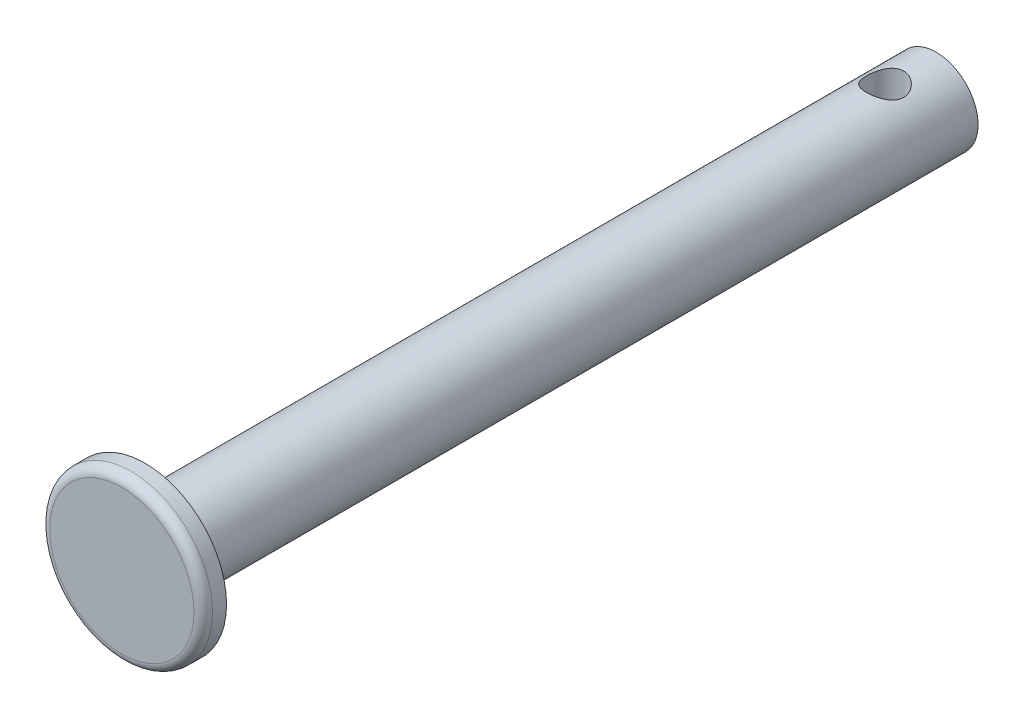
ISO-10303-21;
HEADER;
FILE_DESCRIPTION(('STEP AP214'),'2;1');
FILE_NAME('part.step','',(''),(''),'','','');
FILE_SCHEMA(('AUTOMOTIVE_DESIGN { 1 0 10303 214 1 1 1 1 }'));
ENDSEC;
DATA;
#1=APPLICATION_CONTEXT('core data for automotive mechanical design processes');
#2=APPLICATION_PROTOCOL_DEFINITION('international standard','automotive_design',2000,#1);
#3=PRODUCT_CONTEXT('',#1,'mechanical');
#4=PRODUCT('Part','Part','',(#3));
#5=PRODUCT_RELATED_PRODUCT_CATEGORY('part','',(#4));
#6=PRODUCT_DEFINITION_FORMATION('','',#4);
#7=PRODUCT_DEFINITION_CONTEXT('part definition',#1,'design');
#8=PRODUCT_DEFINITION('design','',#6,#7);
#9=PRODUCT_DEFINITION_SHAPE('','',#8);
#10=(LENGTH_UNIT() NAMED_UNIT(*) SI_UNIT(.MILLI.,.METRE.));
#11=(NAMED_UNIT(*) PLANE_ANGLE_UNIT() SI_UNIT($,.RADIAN.));
#12=(NAMED_UNIT(*) SI_UNIT($,.STERADIAN.) SOLID_ANGLE_UNIT());
#13=UNCERTAINTY_MEASURE_WITH_UNIT(LENGTH_MEASURE(1.E-05),#10,'distance_accuracy_value','');
#14=(GEOMETRIC_REPRESENTATION_CONTEXT(3) GLOBAL_UNCERTAINTY_ASSIGNED_CONTEXT((#13)) GLOBAL_UNIT_ASSIGNED_CONTEXT((#10,
#11,#12)) REPRESENTATION_CONTEXT('',''));
#15=CARTESIAN_POINT('',(0.,0.,0.));
#16=DIRECTION('',(0.,0.,1.));
#17=DIRECTION('',(1.,0.,0.));
#18=AXIS2_PLACEMENT_3D('',#15,#16,#17);
#19=CARTESIAN_POINT('',(0.,0.,5.));
#20=DIRECTION('',(0.,0.,-1.));
#21=DIRECTION('',(-1.,0.,0.));
#22=AXIS2_PLACEMENT_3D('',#19,#20,#21);
#23=CYLINDRICAL_SURFACE('',#22,17.5);
#24=CARTESIAN_POINT('',(0.,0.,3.));
#25=DIRECTION('',(0.,0.,1.));
#26=DIRECTION('',(1.,0.,0.));
#27=AXIS2_PLACEMENT_3D('',#24,#25,#26);
#28=CIRCLE('',#27,17.5);
#29=CARTESIAN_POINT('',(17.5,0.,3.));
#30=VERTEX_POINT('',#29);
#31=EDGE_CURVE('E46',#30,#30,#28,.F.);
#32=ORIENTED_EDGE('',*,*,#31,.T.);
#33=EDGE_LOOP('',(#32));
#34=FACE_BOUND('',#33,.T.);
#35=CARTESIAN_POINT('',(0.,0.,0.));
#36=DIRECTION('',(0.,0.,1.));
#37=DIRECTION('',(1.,0.,0.));
#38=AXIS2_PLACEMENT_3D('',#35,#36,#37);
#39=CIRCLE('',#38,17.5);
#40=CARTESIAN_POINT('',(17.5,0.,0.));
#41=VERTEX_POINT('',#40);
#42=EDGE_CURVE('E56',#41,#41,#39,.T.);
#43=ORIENTED_EDGE('',*,*,#42,.T.);
#44=EDGE_LOOP('',(#43));
#45=FACE_BOUND('',#44,.T.);
#46=ADVANCED_FACE('F33',(#34,#45),#23,.T.);
#47=CARTESIAN_POINT('',(0.,0.,5.));
#48=DIRECTION('',(0.,0.,1.));
#49=DIRECTION('',(1.,0.,0.));
#50=AXIS2_PLACEMENT_3D('',#47,#48,#49);
#51=PLANE('',#50);
#52=CARTESIAN_POINT('',(0.,0.,5.));
#53=DIRECTION('',(0.,0.,1.));
#54=DIRECTION('',(1.,0.,0.));
#55=AXIS2_PLACEMENT_3D('',#52,#53,#54);
#56=CIRCLE('',#55,15.5);
#57=CARTESIAN_POINT('',(15.5,0.,5.));
#58=VERTEX_POINT('',#57);
#59=EDGE_CURVE('E51',#58,#58,#56,.T.);
#60=ORIENTED_EDGE('',*,*,#59,.T.);
#61=EDGE_LOOP('',(#60));
#62=FACE_BOUND('',#61,.T.);
#63=ADVANCED_FACE('F83',(#62),#51,.T.);
#64=CARTESIAN_POINT('',(0.,0.,0.));
#65=DIRECTION('',(0.,0.,1.));
#66=DIRECTION('',(1.,0.,0.));
#67=AXIS2_PLACEMENT_3D('',#64,#65,#66);
#68=PLANE('',#67);
#69=CARTESIAN_POINT('',(0.,0.,0.));
#70=DIRECTION('',(0.,0.,-1.));
#71=DIRECTION('',(-1.,0.,0.));
#72=AXIS2_PLACEMENT_3D('',#69,#70,#71);
#73=CIRCLE('',#72,9.);
#74=CARTESIAN_POINT('',(-9.,0.,0.));
#75=VERTEX_POINT('',#74);
#76=EDGE_CURVE('E10',#75,#75,#73,.T.);
#77=ORIENTED_EDGE('',*,*,#76,.F.);
#78=EDGE_LOOP('',(#77));
#79=FACE_BOUND('',#78,.T.);
#80=ORIENTED_EDGE('',*,*,#42,.F.);
#81=EDGE_LOOP('',(#80));
#82=FACE_BOUND('',#81,.T.);
#83=ADVANCED_FACE('F88',(#79,#82),#68,.F.);
#84=CARTESIAN_POINT('',(0.,0.,3.));
#85=DIRECTION('',(0.,0.,1.));
#86=DIRECTION('',(1.,0.,0.));
#87=AXIS2_PLACEMENT_3D('',#84,#85,#86);
#88=TOROIDAL_SURFACE('',#87,15.5,2.);
#89=ORIENTED_EDGE('',*,*,#31,.F.);
#90=EDGE_LOOP('',(#89));
#91=FACE_BOUND('',#90,.T.);
#92=ORIENTED_EDGE('',*,*,#59,.F.);
#93=EDGE_LOOP('',(#92));
#94=FACE_BOUND('',#93,.T.);
#95=ADVANCED_FACE('F35',(#91,#94),#88,.T.);
#96=CARTESIAN_POINT('',(0.,0.,-170.));
#97=DIRECTION('',(0.,0.,1.));
#98=DIRECTION('',(1.,0.,0.));
#99=AXIS2_PLACEMENT_3D('',#96,#97,#98);
#100=CYLINDRICAL_SURFACE('',#99,9.);
#101=CARTESIAN_POINT('',(0.,-9.,-155.));
#102=CARTESIAN_POINT('',(0.106543560764114,-8.99999931236003,-155.000000836699));
#103=CARTESIAN_POINT('',(0.213114535933688,-8.99810295733528,-155.004262627626));
#104=CARTESIAN_POINT('',(0.425487759472879,-8.99056534028924,-155.021266410651));
#105=CARTESIAN_POINT('',(0.531289533809612,-8.9849219391011,-155.034013246822));
#106=CARTESIAN_POINT('',(0.74149757168032,-8.97002203225641,-155.067884892567));
#107=CARTESIAN_POINT('',(0.845900846236376,-8.96075877099567,-155.089025368053));
#108=CARTESIAN_POINT('',(1.0523739381887,-8.93886560682324,-155.139452717964));
#109=CARTESIAN_POINT('',(1.15444278316294,-8.92623432770846,-155.168742922658));
#110=CARTESIAN_POINT('',(1.4552870647707,-8.88385509084484,-155.268173163624));
#111=CARTESIAN_POINT('',(1.64969223818528,-8.84954694128079,-155.350035466121));
#112=CARTESIAN_POINT('',(2.02169397175996,-8.77205693690159,-155.542157329804));
#113=CARTESIAN_POINT('',(2.19929435076136,-8.72887710525828,-155.65241041797));
#114=CARTESIAN_POINT('',(2.54295194306067,-8.63520005099137,-155.904670409585));
#115=CARTESIAN_POINT('',(2.70796463469602,-8.58444255570291,-156.048005748694));
#116=CARTESIAN_POINT('',(3.01251193717388,-8.48237167141423,-156.359486057858));
#117=CARTESIAN_POINT('',(3.15203136079603,-8.43105797021839,-156.527645709479));
#118=CARTESIAN_POINT('',(3.40970641309573,-8.33031613694453,-156.89592097732));
#119=CARTESIAN_POINT('',(3.52616342827006,-8.28116793674049,-157.097321076473));
#120=CARTESIAN_POINT('',(3.67379855799914,-8.21620901778825,-157.41355835118));
#121=CARTESIAN_POINT('',(3.71851343023117,-8.19601074422211,-157.521369577908));
#122=CARTESIAN_POINT('',(3.79849956446532,-8.15924882688405,-157.741019115666));
#123=CARTESIAN_POINT('',(3.83377590592702,-8.14268322901324,-157.852855223742));
#124=CARTESIAN_POINT('',(3.89288163397949,-8.11458487568386,-158.073790004776));
#125=CARTESIAN_POINT('',(3.91721191584564,-8.10283476289079,-158.1827274267));
#126=CARTESIAN_POINT('',(3.95670961203999,-8.08362129694743,-158.40257833796));
#127=CARTESIAN_POINT('',(3.97188144036291,-8.07615587883754,-158.513490848807));
#128=CARTESIAN_POINT('',(3.99287182782271,-8.06579894008708,-158.736372244823));
#129=CARTESIAN_POINT('',(3.99869365272533,-8.06290582244073,-158.848340747407));
#130=CARTESIAN_POINT('',(4.00091360303008,-8.06180452405908,-159.072389121287));
#131=CARTESIAN_POINT('',(3.99731233389618,-8.06359604232092,-159.184468984967));
#132=CARTESIAN_POINT('',(3.98148137626882,-8.07142338434779,-159.397727180472));
#133=CARTESIAN_POINT('',(3.97005575276389,-8.07706352800997,-159.498980462134));
#134=CARTESIAN_POINT('',(3.9395760613895,-8.09197245318636,-159.700071069174));
#135=CARTESIAN_POINT('',(3.92051952834525,-8.10124240729389,-159.799907926172));
#136=CARTESIAN_POINT('',(3.85217674750056,-8.13408651281412,-160.096237629299));
#137=CARTESIAN_POINT('',(3.79170447177769,-8.16270181226473,-160.289717878033));
#138=CARTESIAN_POINT('',(3.6415000666749,-8.23081734439647,-160.667898489686));
#139=CARTESIAN_POINT('',(3.55114161901361,-8.2705474900895,-160.852304287052));
#140=CARTESIAN_POINT('',(3.34416344596327,-8.356381512277,-161.204143428638));
#141=CARTESIAN_POINT('',(3.22753266369899,-8.40248806916055,-161.37156958372));
#142=CARTESIAN_POINT('',(2.95801583387874,-8.50133279495594,-161.701829779423));
#143=CARTESIAN_POINT('',(2.80270476501178,-8.55427944513663,-161.862627648019));
#144=CARTESIAN_POINT('',(2.4668765144306,-8.65709798777378,-162.156634195721));
#145=CARTESIAN_POINT('',(2.28635173983007,-8.70696894746714,-162.289834533953));
#146=CARTESIAN_POINT('',(1.89830549192188,-8.79984898075653,-162.528426648963));
#147=CARTESIAN_POINT('',(1.69014406889666,-8.84261183911195,-162.632880739051));
#148=CARTESIAN_POINT('',(1.25681485203023,-8.91451161297059,-162.804553847193));
#149=CARTESIAN_POINT('',(1.03165788152718,-8.94365711683337,-162.871796339261));
#150=CARTESIAN_POINT('',(0.587641070885752,-8.98336516942802,-162.962623781355));
#151=CARTESIAN_POINT('',(0.36944233113181,-8.99508492412832,-162.988933410671));
#152=CARTESIAN_POINT('',(-0.0685540826286678,-9.00240007523686,-163.005406229974));
#153=CARTESIAN_POINT('',(-0.288351188214382,-8.9980009485081,-162.995581697598));
#154=CARTESIAN_POINT('',(-0.709814814369027,-8.97430591809511,-162.941912900482));
#155=CARTESIAN_POINT('',(-0.911792765731197,-8.95589038121198,-162.900078378669));
#156=CARTESIAN_POINT('',(-1.30558421565956,-8.90701082021956,-162.786483878066));
#157=CARTESIAN_POINT('',(-1.49739647572632,-8.87654533185795,-162.714720262377));
#158=CARTESIAN_POINT('',(-1.87220783588442,-8.80524764691282,-162.54102286328));
#159=CARTESIAN_POINT('',(-2.05474529218522,-8.76412168349642,-162.43821768326));
#160=CARTESIAN_POINT('',(-2.40063957243038,-8.67576208193102,-162.206294769438));
#161=CARTESIAN_POINT('',(-2.56398799395825,-8.62852578709614,-162.077165576179));
#162=CARTESIAN_POINT('',(-2.88073032703291,-8.52825739375591,-161.784176044225));
#163=CARTESIAN_POINT('',(-3.03226090719451,-8.4750650088176,-161.618355311003));
#164=CARTESIAN_POINT('',(-3.30602071854252,-8.37207677010346,-161.262852120246));
#165=CARTESIAN_POINT('',(-3.42823956174355,-8.32228212493563,-161.073161239414));
#166=CARTESIAN_POINT('',(-3.58807434164479,-8.25404075216361,-160.771754554877));
#167=CARTESIAN_POINT('',(-3.63788387634673,-8.23214803707209,-160.667120267068));
#168=CARTESIAN_POINT('',(-3.72840991291048,-8.19154569522209,-160.453411070359));
#169=CARTESIAN_POINT('',(-3.76913049781947,-8.17283464006355,-160.344338181564));
#170=CARTESIAN_POINT('',(-3.84101557494808,-8.13929816800194,-160.122578264278));
#171=CARTESIAN_POINT('',(-3.87218560166711,-8.1244705014215,-160.009893370908));
#172=CARTESIAN_POINT('',(-3.92460929100956,-8.09927719768152,-159.781750958441));
#173=CARTESIAN_POINT('',(-3.94586407399639,-8.08891105640649,-159.66629375415));
#174=CARTESIAN_POINT('',(-3.9767877017106,-8.07374935283999,-159.443520646671));
#175=CARTESIAN_POINT('',(-3.98728755575061,-8.06855529639578,-159.336346580473));
#176=CARTESIAN_POINT('',(-3.99960939260381,-8.06245450280349,-159.12134014386));
#177=CARTESIAN_POINT('',(-4.00142848498409,-8.06154919368018,-159.013507566146));
#178=CARTESIAN_POINT('',(-3.99635429337704,-8.06406616285806,-158.798155926531));
#179=CARTESIAN_POINT('',(-3.98946605490684,-8.06748593496455,-158.690636719219));
#180=CARTESIAN_POINT('',(-3.96708318300727,-8.07851431964463,-158.476702341545));
#181=CARTESIAN_POINT('',(-3.95158530941064,-8.08612450923878,-158.370287602209));
#182=CARTESIAN_POINT('',(-3.89481025673449,-8.11370655018847,-158.066746652352));
#183=CARTESIAN_POINT('',(-3.84284512159463,-8.13866591875024,-157.871956060774));
#184=CARTESIAN_POINT('',(-3.71108221021499,-8.19957700487955,-157.494001052904));
#185=CARTESIAN_POINT('',(-3.63127638750922,-8.23553189998354,-157.310840015874));
#186=CARTESIAN_POINT('',(-3.44024324515819,-8.31722161393654,-156.948335290135));
#187=CARTESIAN_POINT('',(-3.32733013865014,-8.36343549057003,-156.769988321082));
#188=CARTESIAN_POINT('',(-3.0754694656553,-8.45929191031224,-156.433746751155));
#189=CARTESIAN_POINT('',(-2.93651102511198,-8.50893588001619,-156.275860739571));
#190=CARTESIAN_POINT('',(-2.622172207908,-8.61126362572535,-155.970759497546));
#191=CARTESIAN_POINT('',(-2.44466910724623,-8.66383343564896,-155.825685842609));
#192=CARTESIAN_POINT('',(-2.06586629934032,-8.76186799200868,-155.567115790986));
#193=CARTESIAN_POINT('',(-1.86455578078998,-8.80732948852386,-155.453633819621));
#194=CARTESIAN_POINT('',(-1.55009155680926,-8.86614466582397,-155.310780454512));
#195=CARTESIAN_POINT('',(-1.44376115568191,-8.88411858212819,-155.267874827679));
#196=CARTESIAN_POINT('',(-1.22735110682472,-8.91658812616539,-155.191226067799));
#197=CARTESIAN_POINT('',(-1.11727329280022,-8.93108542793378,-155.157478523981));
#198=CARTESIAN_POINT('',(-0.894475004716065,-8.95614098674219,-155.099597685609));
#199=CARTESIAN_POINT('',(-0.781761539000786,-8.96670865291079,-155.075441416157));
#200=CARTESIAN_POINT('',(-0.554414643007753,-8.9836293170273,-155.036933261201));
#201=CARTESIAN_POINT('',(-0.439782603478108,-8.98998524296699,-155.022574564242));
#202=CARTESIAN_POINT('',(-0.270722867755128,-8.99608997508148,-155.00880385083));
#203=CARTESIAN_POINT('',(-0.21664466049598,-8.99755504734627,-155.005503721119));
#204=CARTESIAN_POINT('',(-0.108380000601335,-8.99951024035253,-155.001101570143));
#205=CARTESIAN_POINT('',(-0.0541935467157946,-9.00000034976913,-154.999999574412));
#206=CARTESIAN_POINT('',(0.,-9.,-155.));
#207=B_SPLINE_CURVE_WITH_KNOTS('',3,(#101,#102,#103,#104,#105,#106,#107,#108,#109,#110,#111,
#112,#113,#114,#115,#116,#117,#118,#119,#120,#121,#122,#123,#124,#125,#126,#127,#128,#129,#130,
#131,#132,#133,#134,#135,#136,#137,#138,#139,#140,#141,#142,#143,#144,#145,#146,#147,#148,#149,
#150,#151,#152,#153,#154,#155,#156,#157,#158,#159,#160,#161,#162,#163,#164,#165,#166,#167,#168,
#169,#170,#171,#172,#173,#174,#175,#176,#177,#178,#179,#180,#181,#182,#183,#184,#185,#186,#187,
#188,#189,#190,#191,#192,#193,#194,#195,#196,#197,#198,#199,#200,#201,#202,#203,#204,#205,#206),
.UNSPECIFIED.,.T.,.F.,(4,2,2,2,2,2,2,2,2,2,2,2,2,2,2,2,2,2,2,2,2,2,2,2,2,2,2,2,2,2,2,2,2,2,2,2,
2,2,2,2,2,2,2,2,2,2,2,2,2,2,2,2,4),(0.,0.31957599549449,0.639334592113708,0.95969281385197,
1.28018213803926,1.91817504615677,2.55602262225845,3.22626867716012,3.89691272815776,
4.6062783907758,4.96122462740455,5.31597945944823,5.65223953951963,5.98833742651793,
6.32431789582035,6.66027677783182,6.96605959233537,7.27194127015289,7.88320420131181,
8.5081879760034,9.13343527205268,9.81959120458709,10.5059542142737,11.2125921876433,
11.9187838863229,12.5755805291255,13.2321540266912,13.8505799936734,14.4690811319118,
15.1068781804635,15.7449534721389,16.4344546029635,17.1241997308767,17.4776093864017,
17.8308599580232,18.1839054338953,18.5369110080658,18.8599212751304,19.183039087411,
19.5059697528594,19.8290220330897,20.4355356034002,21.042224612609,21.6877902452578,
22.3336260075754,23.0359566714552,23.7386075078666,24.0863996614848,24.4340240108549,
24.7808105646473,25.1273557796159,25.2899067151078,25.452459538731),.UNSPECIFIED.);
#208=CARTESIAN_POINT('',(0.,-9.,-155.));
#209=VERTEX_POINT('',#208);
#210=EDGE_CURVE('E37',#209,#209,#207,.T.);
#211=ORIENTED_EDGE('',*,*,#210,.T.);
#212=EDGE_LOOP('',(#211));
#213=FACE_BOUND('',#212,.T.);
#214=CARTESIAN_POINT('',(0.,9.,-155.));
#215=CARTESIAN_POINT('',(-0.106543560764114,8.99999931236003,-155.000000836699));
#216=CARTESIAN_POINT('',(-0.213114535933688,8.99810295733528,-155.004262627626));
#217=CARTESIAN_POINT('',(-0.425487759472879,8.99056534028924,-155.021266410651));
#218=CARTESIAN_POINT('',(-0.531289533809612,8.9849219391011,-155.034013246822));
#219=CARTESIAN_POINT('',(-0.74149757168032,8.97002203225641,-155.067884892567));
#220=CARTESIAN_POINT('',(-0.845900846236376,8.96075877099567,-155.089025368053));
#221=CARTESIAN_POINT('',(-1.0523739381887,8.93886560682324,-155.139452717964));
#222=CARTESIAN_POINT('',(-1.15444278316294,8.92623432770846,-155.168742922658));
#223=CARTESIAN_POINT('',(-1.4552870647707,8.88385509084484,-155.268173163624));
#224=CARTESIAN_POINT('',(-1.64969223818528,8.84954694128079,-155.350035466121));
#225=CARTESIAN_POINT('',(-2.02169397175996,8.77205693690159,-155.542157329804));
#226=CARTESIAN_POINT('',(-2.19929435076136,8.72887710525828,-155.65241041797));
#227=CARTESIAN_POINT('',(-2.54295194306067,8.63520005099137,-155.904670409585));
#228=CARTESIAN_POINT('',(-2.70796463469602,8.58444255570291,-156.048005748694));
#229=CARTESIAN_POINT('',(-3.01251193717388,8.48237167141423,-156.359486057858));
#230=CARTESIAN_POINT('',(-3.15203136079603,8.43105797021839,-156.527645709479));
#231=CARTESIAN_POINT('',(-3.40970641309573,8.33031613694453,-156.89592097732));
#232=CARTESIAN_POINT('',(-3.52616342827006,8.28116793674049,-157.097321076473));
#233=CARTESIAN_POINT('',(-3.67379855799914,8.21620901778825,-157.41355835118));
#234=CARTESIAN_POINT('',(-3.71851343023117,8.19601074422211,-157.521369577908));
#235=CARTESIAN_POINT('',(-3.79849956446532,8.15924882688405,-157.741019115666));
#236=CARTESIAN_POINT('',(-3.83377590592702,8.14268322901324,-157.852855223742));
#237=CARTESIAN_POINT('',(-3.89288163397949,8.11458487568386,-158.073790004776));
#238=CARTESIAN_POINT('',(-3.91721191584564,8.10283476289079,-158.1827274267));
#239=CARTESIAN_POINT('',(-3.95670961203999,8.08362129694743,-158.40257833796));
#240=CARTESIAN_POINT('',(-3.97188144036291,8.07615587883754,-158.513490848807));
#241=CARTESIAN_POINT('',(-3.99287182782271,8.06579894008708,-158.736372244823));
#242=CARTESIAN_POINT('',(-3.99869365272533,8.06290582244073,-158.848340747407));
#243=CARTESIAN_POINT('',(-4.00091360303008,8.06180452405908,-159.072389121287));
#244=CARTESIAN_POINT('',(-3.99731233389618,8.06359604232092,-159.184468984967));
#245=CARTESIAN_POINT('',(-3.98148137626882,8.07142338434779,-159.397727180472));
#246=CARTESIAN_POINT('',(-3.97005575276389,8.07706352800997,-159.498980462134));
#247=CARTESIAN_POINT('',(-3.9395760613895,8.09197245318636,-159.700071069174));
#248=CARTESIAN_POINT('',(-3.92051952834525,8.10124240729389,-159.799907926172));
#249=CARTESIAN_POINT('',(-3.85217674750056,8.13408651281412,-160.096237629299));
#250=CARTESIAN_POINT('',(-3.79170447177769,8.16270181226473,-160.289717878033));
#251=CARTESIAN_POINT('',(-3.6415000666749,8.23081734439647,-160.667898489686));
#252=CARTESIAN_POINT('',(-3.55114161901361,8.2705474900895,-160.852304287052));
#253=CARTESIAN_POINT('',(-3.34416344596327,8.356381512277,-161.204143428638));
#254=CARTESIAN_POINT('',(-3.22753266369899,8.40248806916055,-161.37156958372));
#255=CARTESIAN_POINT('',(-2.95801583387874,8.50133279495594,-161.701829779423));
#256=CARTESIAN_POINT('',(-2.80270476501178,8.55427944513663,-161.862627648019));
#257=CARTESIAN_POINT('',(-2.4668765144306,8.65709798777378,-162.156634195721));
#258=CARTESIAN_POINT('',(-2.28635173983007,8.70696894746714,-162.289834533953));
#259=CARTESIAN_POINT('',(-1.89830549192188,8.79984898075653,-162.528426648963));
#260=CARTESIAN_POINT('',(-1.69014406889666,8.84261183911195,-162.632880739051));
#261=CARTESIAN_POINT('',(-1.25681485203023,8.91451161297059,-162.804553847193));
#262=CARTESIAN_POINT('',(-1.03165788152718,8.94365711683337,-162.871796339261));
#263=CARTESIAN_POINT('',(-0.587641070885752,8.98336516942802,-162.962623781355));
#264=CARTESIAN_POINT('',(-0.36944233113181,8.99508492412832,-162.988933410671));
#265=CARTESIAN_POINT('',(0.0685540826286678,9.00240007523686,-163.005406229974));
#266=CARTESIAN_POINT('',(0.288351188214382,8.9980009485081,-162.995581697598));
#267=CARTESIAN_POINT('',(0.709814814369027,8.97430591809511,-162.941912900482));
#268=CARTESIAN_POINT('',(0.911792765731197,8.95589038121198,-162.900078378669));
#269=CARTESIAN_POINT('',(1.30558421565956,8.90701082021956,-162.786483878066));
#270=CARTESIAN_POINT('',(1.49739647572632,8.87654533185795,-162.714720262377));
#271=CARTESIAN_POINT('',(1.87220783588442,8.80524764691282,-162.54102286328));
#272=CARTESIAN_POINT('',(2.05474529218522,8.76412168349642,-162.43821768326));
#273=CARTESIAN_POINT('',(2.40063957243038,8.67576208193102,-162.206294769438));
#274=CARTESIAN_POINT('',(2.56398799395825,8.62852578709614,-162.077165576179));
#275=CARTESIAN_POINT('',(2.88073032703291,8.52825739375591,-161.784176044225));
#276=CARTESIAN_POINT('',(3.03226090719451,8.4750650088176,-161.618355311003));
#277=CARTESIAN_POINT('',(3.30602071854252,8.37207677010346,-161.262852120246));
#278=CARTESIAN_POINT('',(3.42823956174355,8.32228212493563,-161.073161239414));
#279=CARTESIAN_POINT('',(3.58807434164479,8.25404075216361,-160.771754554877));
#280=CARTESIAN_POINT('',(3.63788387634673,8.23214803707209,-160.667120267068));
#281=CARTESIAN_POINT('',(3.72840991291048,8.19154569522209,-160.453411070359));
#282=CARTESIAN_POINT('',(3.76913049781947,8.17283464006355,-160.344338181564));
#283=CARTESIAN_POINT('',(3.84101557494808,8.13929816800194,-160.122578264278));
#284=CARTESIAN_POINT('',(3.87218560166711,8.1244705014215,-160.009893370908));
#285=CARTESIAN_POINT('',(3.92460929100956,8.09927719768152,-159.781750958441));
#286=CARTESIAN_POINT('',(3.94586407399639,8.08891105640649,-159.66629375415));
#287=CARTESIAN_POINT('',(3.9767877017106,8.07374935283999,-159.443520646671));
#288=CARTESIAN_POINT('',(3.98728755575061,8.06855529639578,-159.336346580473));
#289=CARTESIAN_POINT('',(3.99960939260381,8.06245450280349,-159.12134014386));
#290=CARTESIAN_POINT('',(4.00142848498409,8.06154919368018,-159.013507566146));
#291=CARTESIAN_POINT('',(3.99635429337704,8.06406616285806,-158.798155926531));
#292=CARTESIAN_POINT('',(3.98946605490684,8.06748593496455,-158.690636719219));
#293=CARTESIAN_POINT('',(3.96708318300727,8.07851431964463,-158.476702341545));
#294=CARTESIAN_POINT('',(3.95158530941064,8.08612450923878,-158.370287602209));
#295=CARTESIAN_POINT('',(3.89481025673449,8.11370655018847,-158.066746652352));
#296=CARTESIAN_POINT('',(3.84284512159463,8.13866591875024,-157.871956060774));
#297=CARTESIAN_POINT('',(3.71108221021499,8.19957700487955,-157.494001052904));
#298=CARTESIAN_POINT('',(3.63127638750922,8.23553189998354,-157.310840015874));
#299=CARTESIAN_POINT('',(3.44024324515819,8.31722161393654,-156.948335290135));
#300=CARTESIAN_POINT('',(3.32733013865014,8.36343549057003,-156.769988321082));
#301=CARTESIAN_POINT('',(3.0754694656553,8.45929191031224,-156.433746751155));
#302=CARTESIAN_POINT('',(2.93651102511198,8.50893588001619,-156.275860739571));
#303=CARTESIAN_POINT('',(2.622172207908,8.61126362572535,-155.970759497546));
#304=CARTESIAN_POINT('',(2.44466910724623,8.66383343564896,-155.825685842609));
#305=CARTESIAN_POINT('',(2.06586629934032,8.76186799200868,-155.567115790986));
#306=CARTESIAN_POINT('',(1.86455578078998,8.80732948852386,-155.453633819621));
#307=CARTESIAN_POINT('',(1.55009155680926,8.86614466582397,-155.310780454512));
#308=CARTESIAN_POINT('',(1.44376115568191,8.88411858212819,-155.267874827679));
#309=CARTESIAN_POINT('',(1.22735110682472,8.91658812616539,-155.191226067799));
#310=CARTESIAN_POINT('',(1.11727329280022,8.93108542793378,-155.157478523981));
#311=CARTESIAN_POINT('',(0.894475004716065,8.95614098674219,-155.099597685609));
#312=CARTESIAN_POINT('',(0.781761539000786,8.96670865291079,-155.075441416157));
#313=CARTESIAN_POINT('',(0.554414643007753,8.9836293170273,-155.036933261201));
#314=CARTESIAN_POINT('',(0.439782603478108,8.98998524296699,-155.022574564242));
#315=CARTESIAN_POINT('',(0.270722867755128,8.99608997508148,-155.00880385083));
#316=CARTESIAN_POINT('',(0.21664466049598,8.99755504734627,-155.005503721119));
#317=CARTESIAN_POINT('',(0.108380000601335,8.99951024035253,-155.001101570143));
#318=CARTESIAN_POINT('',(0.0541935467157946,9.00000034976913,-154.999999574412));
#319=CARTESIAN_POINT('',(0.,9.,-155.));
#320=B_SPLINE_CURVE_WITH_KNOTS('',3,(#214,#215,#216,#217,#218,#219,#220,#221,#222,#223,#224,
#225,#226,#227,#228,#229,#230,#231,#232,#233,#234,#235,#236,#237,#238,#239,#240,#241,#242,#243,
#244,#245,#246,#247,#248,#249,#250,#251,#252,#253,#254,#255,#256,#257,#258,#259,#260,#261,#262,
#263,#264,#265,#266,#267,#268,#269,#270,#271,#272,#273,#274,#275,#276,#277,#278,#279,#280,#281,
#282,#283,#284,#285,#286,#287,#288,#289,#290,#291,#292,#293,#294,#295,#296,#297,#298,#299,#300,
#301,#302,#303,#304,#305,#306,#307,#308,#309,#310,#311,#312,#313,#314,#315,#316,#317,#318,#319),
.UNSPECIFIED.,.T.,.F.,(4,2,2,2,2,2,2,2,2,2,2,2,2,2,2,2,2,2,2,2,2,2,2,2,2,2,2,2,2,2,2,2,2,2,2,2,
2,2,2,2,2,2,2,2,2,2,2,2,2,2,2,2,4),(0.,0.31957599549449,0.639334592113708,0.95969281385197,
1.28018213803926,1.91817504615677,2.55602262225845,3.22626867716012,3.89691272815776,
4.6062783907758,4.96122462740455,5.31597945944823,5.65223953951963,5.98833742651793,
6.32431789582035,6.66027677783182,6.96605959233537,7.27194127015289,7.88320420131181,
8.5081879760034,9.13343527205268,9.81959120458709,10.5059542142737,11.2125921876433,
11.9187838863229,12.5755805291255,13.2321540266912,13.8505799936734,14.4690811319118,
15.1068781804635,15.7449534721389,16.4344546029635,17.1241997308767,17.4776093864017,
17.8308599580232,18.1839054338953,18.5369110080658,18.8599212751304,19.183039087411,
19.5059697528594,19.8290220330897,20.4355356034002,21.042224612609,21.6877902452578,
22.3336260075754,23.0359566714552,23.7386075078666,24.0863996614848,24.4340240108549,
24.7808105646473,25.1273557796159,25.2899067151078,25.452459538731),.UNSPECIFIED.);
#321=CARTESIAN_POINT('',(0.,9.,-155.));
#322=VERTEX_POINT('',#321);
#323=EDGE_CURVE('E60',#322,#322,#320,.T.);
#324=ORIENTED_EDGE('',*,*,#323,.T.);
#325=EDGE_LOOP('',(#324));
#326=FACE_BOUND('',#325,.T.);
#327=CARTESIAN_POINT('',(0.,0.,-170.));
#328=DIRECTION('',(0.,0.,-1.));
#329=DIRECTION('',(-1.,0.,0.));
#330=AXIS2_PLACEMENT_3D('',#327,#328,#329);
#331=CIRCLE('',#330,9.);
#332=CARTESIAN_POINT('',(-9.,0.,-170.));
#333=VERTEX_POINT('',#332);
#334=EDGE_CURVE('E55',#333,#333,#331,.T.);
#335=ORIENTED_EDGE('',*,*,#334,.F.);
#336=EDGE_LOOP('',(#335));
#337=FACE_BOUND('',#336,.T.);
#338=ORIENTED_EDGE('',*,*,#76,.T.);
#339=EDGE_LOOP('',(#338));
#340=FACE_BOUND('',#339,.T.);
#341=ADVANCED_FACE('F65',(#213,#326,#337,#340),#100,.T.);
#342=CARTESIAN_POINT('',(0.,0.,-170.));
#343=DIRECTION('',(0.,0.,-1.));
#344=DIRECTION('',(-1.,0.,0.));
#345=AXIS2_PLACEMENT_3D('',#342,#343,#344);
#346=PLANE('',#345);
#347=ORIENTED_EDGE('',*,*,#334,.T.);
#348=EDGE_LOOP('',(#347));
#349=FACE_BOUND('',#348,.T.);
#350=ADVANCED_FACE('F72',(#349),#346,.T.);
#351=CARTESIAN_POINT('',(0.,-85.,-159.));
#352=DIRECTION('',(0.,1.,0.));
#353=DIRECTION('',(0.,0.,1.));
#354=AXIS2_PLACEMENT_3D('',#351,#352,#353);
#355=CYLINDRICAL_SURFACE('',#354,4.);
#356=ORIENTED_EDGE('',*,*,#323,.F.);
#357=EDGE_LOOP('',(#356));
#358=FACE_BOUND('',#357,.T.);
#359=ORIENTED_EDGE('',*,*,#210,.F.);
#360=EDGE_LOOP('',(#359));
#361=FACE_BOUND('',#360,.T.);
#362=ADVANCED_FACE('F69',(#358,#361),#355,.F.);
#363=CLOSED_SHELL('',(#46,#63,#83,#95,#341,#350,#362));
#364=MANIFOLD_SOLID_BREP('B2',#363);
#365=ADVANCED_BREP_SHAPE_REPRESENTATION('',(#18,#364),#14);
#366=SHAPE_DEFINITION_REPRESENTATION(#9,#365);
ENDSEC;
END-ISO-10303-21;
